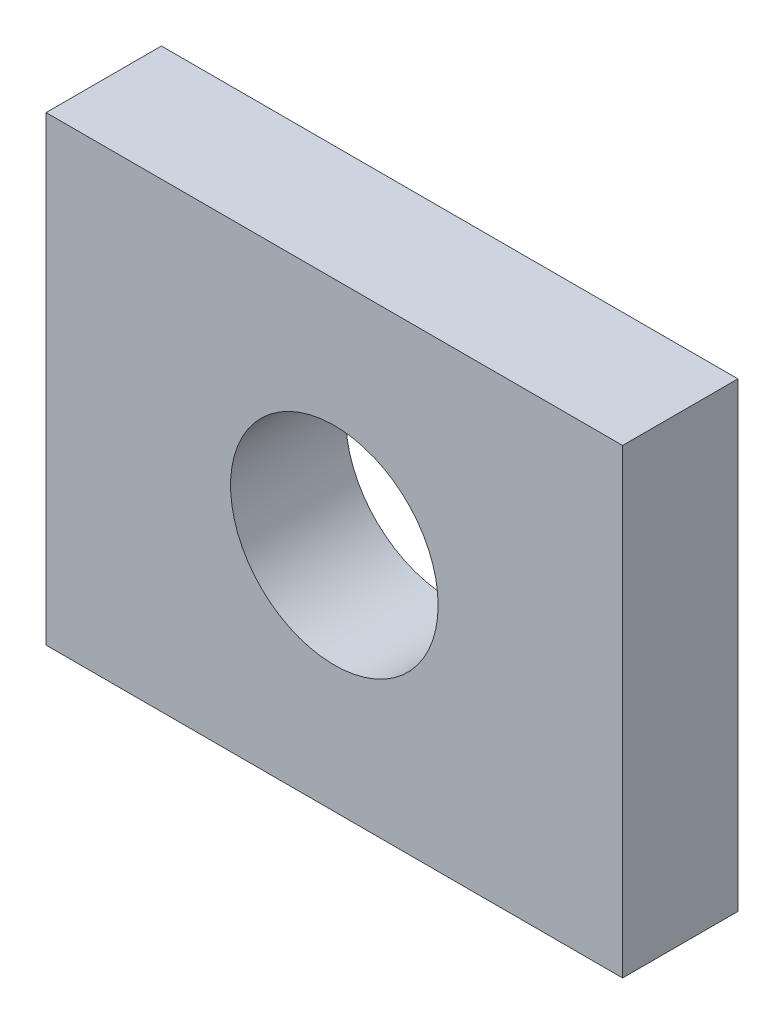
ISO-10303-21;
HEADER;
FILE_DESCRIPTION(('STEP AP214'),'2;1');
FILE_NAME('part.step','',(''),(''),'','','');
FILE_SCHEMA(('AUTOMOTIVE_DESIGN { 1 0 10303 214 1 1 1 1 }'));
ENDSEC;
DATA;
#1=APPLICATION_CONTEXT('core data for automotive mechanical design processes');
#2=APPLICATION_PROTOCOL_DEFINITION('international standard','automotive_design',2000,#1);
#3=PRODUCT_CONTEXT('',#1,'mechanical');
#4=PRODUCT('Part','Part','',(#3));
#5=PRODUCT_RELATED_PRODUCT_CATEGORY('part','',(#4));
#6=PRODUCT_DEFINITION_FORMATION('','',#4);
#7=PRODUCT_DEFINITION_CONTEXT('part definition',#1,'design');
#8=PRODUCT_DEFINITION('design','',#6,#7);
#9=PRODUCT_DEFINITION_SHAPE('','',#8);
#10=(LENGTH_UNIT() NAMED_UNIT(*) SI_UNIT(.MILLI.,.METRE.));
#11=(NAMED_UNIT(*) PLANE_ANGLE_UNIT() SI_UNIT($,.RADIAN.));
#12=(NAMED_UNIT(*) SI_UNIT($,.STERADIAN.) SOLID_ANGLE_UNIT());
#13=UNCERTAINTY_MEASURE_WITH_UNIT(LENGTH_MEASURE(1.E-05),#10,'distance_accuracy_value','');
#14=(GEOMETRIC_REPRESENTATION_CONTEXT(3) GLOBAL_UNCERTAINTY_ASSIGNED_CONTEXT((#13)) GLOBAL_UNIT_ASSIGNED_CONTEXT((#10,
#11,#12)) REPRESENTATION_CONTEXT('',''));
#15=CARTESIAN_POINT('',(0.,0.,0.));
#16=DIRECTION('',(0.,0.,1.));
#17=DIRECTION('',(1.,0.,0.));
#18=AXIS2_PLACEMENT_3D('',#15,#16,#17);
#19=CARTESIAN_POINT('',(36.9999999999999,45.,-5.));
#20=DIRECTION('',(-1.,0.,0.));
#21=DIRECTION('',(0.,-1.,0.));
#22=AXIS2_PLACEMENT_3D('',#19,#20,#21);
#23=PLANE('',#22);
#24=DIRECTION('',(0.,-1.,0.));
#25=VECTOR('',#24,1.);
#26=CARTESIAN_POINT('',(36.9999999999999,45.,5.));
#27=LINE('',#26,#25);
#28=CARTESIAN_POINT('',(36.9999999999999,45.,5.));
#29=VERTEX_POINT('',#28);
#30=CARTESIAN_POINT('',(36.9999999999999,4.99999999999999,5.));
#31=VERTEX_POINT('',#30);
#32=EDGE_CURVE('E103',#29,#31,#27,.T.);
#33=ORIENTED_EDGE('',*,*,#32,.F.);
#34=DIRECTION('',(0.,0.,1.));
#35=VECTOR('',#34,1.);
#36=CARTESIAN_POINT('',(36.9999999999999,45.,-5.));
#37=LINE('',#36,#35);
#38=CARTESIAN_POINT('',(36.9999999999999,45.,-5.));
#39=VERTEX_POINT('',#38);
#40=EDGE_CURVE('E11',#39,#29,#37,.T.);
#41=ORIENTED_EDGE('',*,*,#40,.F.);
#42=DIRECTION('',(0.,-1.,0.));
#43=VECTOR('',#42,1.);
#44=CARTESIAN_POINT('',(36.9999999999999,45.,-5.));
#45=LINE('',#44,#43);
#46=CARTESIAN_POINT('',(36.9999999999999,4.99999999999999,-5.));
#47=VERTEX_POINT('',#46);
#48=EDGE_CURVE('E96',#39,#47,#45,.T.);
#49=ORIENTED_EDGE('',*,*,#48,.T.);
#50=DIRECTION('',(0.,0.,1.));
#51=VECTOR('',#50,1.);
#52=CARTESIAN_POINT('',(36.9999999999999,4.99999999999999,-5.));
#53=LINE('',#52,#51);
#54=EDGE_CURVE('E41',#47,#31,#53,.T.);
#55=ORIENTED_EDGE('',*,*,#54,.T.);
#56=EDGE_LOOP('',(#33,#41,#49,#55));
#57=FACE_BOUND('',#56,.T.);
#58=ADVANCED_FACE('F38',(#57),#23,.T.);
#59=CARTESIAN_POINT('',(36.9999999999999,45.,-5.));
#60=DIRECTION('',(0.,1.,0.));
#61=DIRECTION('',(-1.,0.,0.));
#62=AXIS2_PLACEMENT_3D('',#59,#60,#61);
#63=PLANE('',#62);
#64=DIRECTION('',(-1.,0.,0.));
#65=VECTOR('',#64,1.);
#66=CARTESIAN_POINT('',(36.9999999999999,45.,5.));
#67=LINE('',#66,#65);
#68=CARTESIAN_POINT('',(86.9999999999999,45.,5.));
#69=VERTEX_POINT('',#68);
#70=EDGE_CURVE('E98',#69,#29,#67,.T.);
#71=ORIENTED_EDGE('',*,*,#70,.F.);
#72=DIRECTION('',(0.,0.,1.));
#73=VECTOR('',#72,1.);
#74=CARTESIAN_POINT('',(86.9999999999999,45.,-5.));
#75=LINE('',#74,#73);
#76=CARTESIAN_POINT('',(86.9999999999999,45.,-5.));
#77=VERTEX_POINT('',#76);
#78=EDGE_CURVE('E47',#77,#69,#75,.T.);
#79=ORIENTED_EDGE('',*,*,#78,.F.);
#80=DIRECTION('',(-1.,0.,0.));
#81=VECTOR('',#80,1.);
#82=CARTESIAN_POINT('',(36.9999999999999,45.,-5.));
#83=LINE('',#82,#81);
#84=EDGE_CURVE('E93',#77,#39,#83,.T.);
#85=ORIENTED_EDGE('',*,*,#84,.T.);
#86=ORIENTED_EDGE('',*,*,#40,.T.);
#87=EDGE_LOOP('',(#71,#79,#85,#86));
#88=FACE_BOUND('',#87,.T.);
#89=ADVANCED_FACE('F114',(#88),#63,.T.);
#90=CARTESIAN_POINT('',(86.9999999999999,45.,-5.));
#91=DIRECTION('',(1.,0.,0.));
#92=DIRECTION('',(0.,1.,0.));
#93=AXIS2_PLACEMENT_3D('',#90,#91,#92);
#94=PLANE('',#93);
#95=DIRECTION('',(0.,1.,0.));
#96=VECTOR('',#95,1.);
#97=CARTESIAN_POINT('',(86.9999999999999,45.,5.));
#98=LINE('',#97,#96);
#99=CARTESIAN_POINT('',(87.,5.,5.));
#100=VERTEX_POINT('',#99);
#101=EDGE_CURVE('E88',#100,#69,#98,.T.);
#102=ORIENTED_EDGE('',*,*,#101,.F.);
#103=DIRECTION('',(0.,0.,1.));
#104=VECTOR('',#103,1.);
#105=CARTESIAN_POINT('',(87.,5.,-5.));
#106=LINE('',#105,#104);
#107=CARTESIAN_POINT('',(87.,5.,-5.));
#108=VERTEX_POINT('',#107);
#109=EDGE_CURVE('E83',#108,#100,#106,.T.);
#110=ORIENTED_EDGE('',*,*,#109,.F.);
#111=DIRECTION('',(0.,1.,0.));
#112=VECTOR('',#111,1.);
#113=CARTESIAN_POINT('',(86.9999999999999,45.,-5.));
#114=LINE('',#113,#112);
#115=EDGE_CURVE('E86',#108,#77,#114,.T.);
#116=ORIENTED_EDGE('',*,*,#115,.T.);
#117=ORIENTED_EDGE('',*,*,#78,.T.);
#118=EDGE_LOOP('',(#102,#110,#116,#117));
#119=FACE_BOUND('',#118,.T.);
#120=ADVANCED_FACE('F85',(#119),#94,.T.);
#121=CARTESIAN_POINT('',(36.9999999999999,4.99999999999999,-5.));
#122=DIRECTION('',(0.,-1.,0.));
#123=DIRECTION('',(1.,0.,0.));
#124=AXIS2_PLACEMENT_3D('',#121,#122,#123);
#125=PLANE('',#124);
#126=DIRECTION('',(1.,0.,0.));
#127=VECTOR('',#126,1.);
#128=CARTESIAN_POINT('',(36.9999999999999,4.99999999999999,5.));
#129=LINE('',#128,#127);
#130=EDGE_CURVE('E106',#31,#100,#129,.T.);
#131=ORIENTED_EDGE('',*,*,#130,.F.);
#132=ORIENTED_EDGE('',*,*,#54,.F.);
#133=DIRECTION('',(1.,0.,0.));
#134=VECTOR('',#133,1.);
#135=CARTESIAN_POINT('',(36.9999999999999,4.99999999999999,-5.));
#136=LINE('',#135,#134);
#137=EDGE_CURVE('E92',#47,#108,#136,.T.);
#138=ORIENTED_EDGE('',*,*,#137,.T.);
#139=ORIENTED_EDGE('',*,*,#109,.T.);
#140=EDGE_LOOP('',(#131,#132,#138,#139));
#141=FACE_BOUND('',#140,.T.);
#142=ADVANCED_FACE('F95',(#141),#125,.T.);
#143=CARTESIAN_POINT('',(0.,0.,-5.));
#144=DIRECTION('',(0.,0.,1.));
#145=DIRECTION('',(1.,0.,0.));
#146=AXIS2_PLACEMENT_3D('',#143,#144,#145);
#147=PLANE('',#146);
#148=CARTESIAN_POINT('',(61.9999999999999,25.,-5.));
#149=DIRECTION('',(0.,0.,1.));
#150=DIRECTION('',(1.,0.,0.));
#151=AXIS2_PLACEMENT_3D('',#148,#149,#150);
#152=CIRCLE('',#151,8.99999999999999);
#153=CARTESIAN_POINT('',(70.9999999999999,25.,-5.));
#154=VERTEX_POINT('',#153);
#155=EDGE_CURVE('E107',#154,#154,#152,.T.);
#156=ORIENTED_EDGE('',*,*,#155,.T.);
#157=EDGE_LOOP('',(#156));
#158=FACE_BOUND('',#157,.T.);
#159=ORIENTED_EDGE('',*,*,#48,.F.);
#160=ORIENTED_EDGE('',*,*,#84,.F.);
#161=ORIENTED_EDGE('',*,*,#115,.F.);
#162=ORIENTED_EDGE('',*,*,#137,.F.);
#163=EDGE_LOOP('',(#159,#160,#161,#162));
#164=FACE_BOUND('',#163,.T.);
#165=ADVANCED_FACE('F91',(#158,#164),#147,.F.);
#166=CARTESIAN_POINT('',(0.,0.,5.));
#167=DIRECTION('',(0.,0.,1.));
#168=DIRECTION('',(1.,0.,0.));
#169=AXIS2_PLACEMENT_3D('',#166,#167,#168);
#170=PLANE('',#169);
#171=CARTESIAN_POINT('',(61.9999999999999,25.,5.));
#172=DIRECTION('',(0.,0.,1.));
#173=DIRECTION('',(1.,0.,0.));
#174=AXIS2_PLACEMENT_3D('',#171,#172,#173);
#175=CIRCLE('',#174,8.99999999999999);
#176=CARTESIAN_POINT('',(70.9999999999999,25.,5.));
#177=VERTEX_POINT('',#176);
#178=EDGE_CURVE('E143',#177,#177,#175,.T.);
#179=ORIENTED_EDGE('',*,*,#178,.F.);
#180=EDGE_LOOP('',(#179));
#181=FACE_BOUND('',#180,.T.);
#182=ORIENTED_EDGE('',*,*,#32,.T.);
#183=ORIENTED_EDGE('',*,*,#130,.T.);
#184=ORIENTED_EDGE('',*,*,#101,.T.);
#185=ORIENTED_EDGE('',*,*,#70,.T.);
#186=EDGE_LOOP('',(#182,#183,#184,#185));
#187=FACE_BOUND('',#186,.T.);
#188=ADVANCED_FACE('F113',(#181,#187),#170,.T.);
#189=CARTESIAN_POINT('',(61.9999999999999,25.,5.));
#190=DIRECTION('',(0.,0.,1.));
#191=DIRECTION('',(1.,0.,0.));
#192=AXIS2_PLACEMENT_3D('',#189,#190,#191);
#193=CYLINDRICAL_SURFACE('',#192,8.99999999999999);
#194=ORIENTED_EDGE('',*,*,#178,.T.);
#195=EDGE_LOOP('',(#194));
#196=FACE_BOUND('',#195,.T.);
#197=ORIENTED_EDGE('',*,*,#155,.F.);
#198=EDGE_LOOP('',(#197));
#199=FACE_BOUND('',#198,.T.);
#200=ADVANCED_FACE('F132',(#196,#199),#193,.F.);
#201=CLOSED_SHELL('',(#58,#89,#120,#142,#165,#188,#200));
#202=MANIFOLD_SOLID_BREP('B2',#201);
#203=ADVANCED_BREP_SHAPE_REPRESENTATION('',(#18,#202),#14);
#204=SHAPE_DEFINITION_REPRESENTATION(#9,#203);
ENDSEC;
END-ISO-10303-21;
